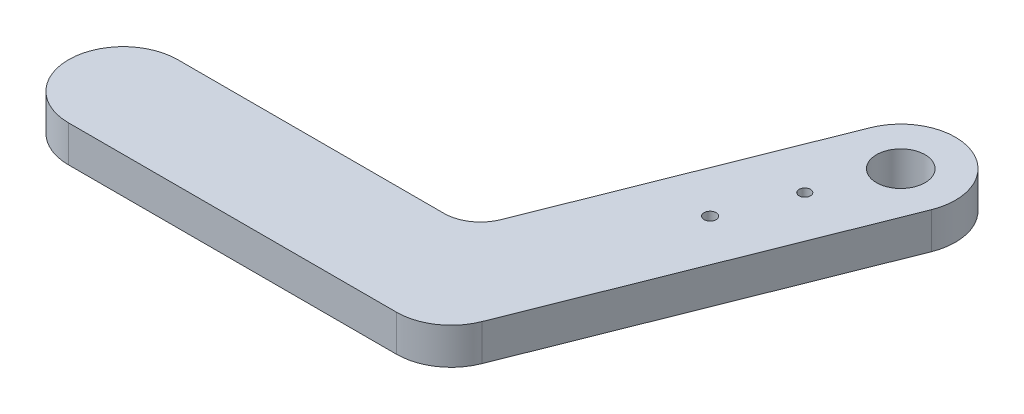
ISO-10303-21;
HEADER;
FILE_DESCRIPTION(('STEP AP214'),'2;1');
FILE_NAME('part.step','',(''),(''),'','','');
FILE_SCHEMA(('AUTOMOTIVE_DESIGN { 1 0 10303 214 1 1 1 1 }'));
ENDSEC;
DATA;
#1=APPLICATION_CONTEXT('core data for automotive mechanical design processes');
#2=APPLICATION_PROTOCOL_DEFINITION('international standard','automotive_design',2000,#1);
#3=PRODUCT_CONTEXT('',#1,'mechanical');
#4=PRODUCT('Part','Part','',(#3));
#5=PRODUCT_RELATED_PRODUCT_CATEGORY('part','',(#4));
#6=PRODUCT_DEFINITION_FORMATION('','',#4);
#7=PRODUCT_DEFINITION_CONTEXT('part definition',#1,'design');
#8=PRODUCT_DEFINITION('design','',#6,#7);
#9=PRODUCT_DEFINITION_SHAPE('','',#8);
#10=(LENGTH_UNIT() NAMED_UNIT(*) SI_UNIT(.MILLI.,.METRE.));
#11=(NAMED_UNIT(*) PLANE_ANGLE_UNIT() SI_UNIT($,.RADIAN.));
#12=(NAMED_UNIT(*) SI_UNIT($,.STERADIAN.) SOLID_ANGLE_UNIT());
#13=UNCERTAINTY_MEASURE_WITH_UNIT(LENGTH_MEASURE(1.E-05),#10,'distance_accuracy_value','');
#14=(GEOMETRIC_REPRESENTATION_CONTEXT(3) GLOBAL_UNCERTAINTY_ASSIGNED_CONTEXT((#13)) GLOBAL_UNIT_ASSIGNED_CONTEXT((#10,
#11,#12)) REPRESENTATION_CONTEXT('',''));
#15=CARTESIAN_POINT('',(0.,0.,0.));
#16=DIRECTION('',(0.,0.,1.));
#17=DIRECTION('',(1.,0.,0.));
#18=AXIS2_PLACEMENT_3D('',#15,#16,#17);
#19=CARTESIAN_POINT('',(16.6070872477086,3.,-21.11705231599));
#20=DIRECTION('',(0.,-1.,0.));
#21=DIRECTION('',(0.,0.,-1.));
#22=AXIS2_PLACEMENT_3D('',#19,#20,#21);
#23=PLANE('',#22);
#24=CARTESIAN_POINT('',(16.6070872477086,3.,-21.11705231599));
#25=DIRECTION('',(0.,1.,0.));
#26=DIRECTION('',(0.,0.,-1.));
#27=AXIS2_PLACEMENT_3D('',#24,#25,#26);
#28=CIRCLE('',#27,4.5);
#29=CARTESIAN_POINT('',(20.7889791559015,3.,-19.4551918921904));
#30=VERTEX_POINT('',#29);
#31=CARTESIAN_POINT('',(12.4251953395158,3.,-22.7789127397895));
#32=VERTEX_POINT('',#31);
#33=EDGE_CURVE('E145',#30,#32,#28,.T.);
#34=ORIENTED_EDGE('',*,*,#33,.T.);
#35=DIRECTION('',(-0.369302316399907,0.,0.92930931293174));
#36=VECTOR('',#35,1.);
#37=CARTESIAN_POINT('',(12.4251953395158,3.,-22.7789127397895));
#38=LINE('',#37,#36);
#39=CARTESIAN_POINT('',(3.7798472766123,3.,-1.02382994823567));
#40=VERTEX_POINT('',#39);
#41=EDGE_CURVE('E93',#32,#40,#38,.T.);
#42=ORIENTED_EDGE('',*,*,#41,.T.);
#43=CARTESIAN_POINT('',(0.991919337817082,3.,-2.13173689743539));
#44=DIRECTION('',(0.,-1.,0.));
#45=DIRECTION('',(0.,0.,-1.));
#46=AXIS2_PLACEMENT_3D('',#43,#44,#45);
#47=CIRCLE('',#46,3.);
#48=CARTESIAN_POINT('',(0.991919337817078,3.,0.868263102564605));
#49=VERTEX_POINT('',#48);
#50=EDGE_CURVE('E160',#40,#49,#47,.T.);
#51=ORIENTED_EDGE('',*,*,#50,.T.);
#52=DIRECTION('',(-1.,0.,0.));
#53=VECTOR('',#52,1.);
#54=CARTESIAN_POINT('',(0.991919337817078,3.,0.868263102564605));
#55=LINE('',#54,#53);
#56=CARTESIAN_POINT('',(-20.9180287696887,3.,0.868263102564611));
#57=VERTEX_POINT('',#56);
#58=EDGE_CURVE('E173',#49,#57,#55,.T.);
#59=ORIENTED_EDGE('',*,*,#58,.T.);
#60=CARTESIAN_POINT('',(-20.9180287696887,3.,5.36826310256461));
#61=DIRECTION('',(0.,1.,0.));
#62=DIRECTION('',(0.,0.,1.));
#63=AXIS2_PLACEMENT_3D('',#60,#61,#62);
#64=CIRCLE('',#63,4.5);
#65=CARTESIAN_POINT('',(-20.9180287696887,3.,9.86826310256457));
#66=VERTEX_POINT('',#65);
#67=EDGE_CURVE('E112',#57,#66,#64,.T.);
#68=ORIENTED_EDGE('',*,*,#67,.T.);
#69=DIRECTION('',(1.,0.,0.));
#70=VECTOR('',#69,1.);
#71=CARTESIAN_POINT('',(-20.9180287696887,3.,9.86826310256457));
#72=LINE('',#71,#70);
#73=CARTESIAN_POINT('',(6.08197123031129,3.,9.86826310256461));
#74=VERTEX_POINT('',#73);
#75=EDGE_CURVE('E106',#66,#74,#72,.T.);
#76=ORIENTED_EDGE('',*,*,#75,.T.);
#77=CARTESIAN_POINT('',(6.08197123031129,3.,5.36826310256461));
#78=DIRECTION('',(0.,1.,0.));
#79=DIRECTION('',(0.,0.,-1.));
#80=AXIS2_PLACEMENT_3D('',#77,#78,#79);
#81=CIRCLE('',#80,4.5);
#82=CARTESIAN_POINT('',(10.2638631385041,3.,7.03012352636419));
#83=VERTEX_POINT('',#82);
#84=EDGE_CURVE('E110',#74,#83,#81,.T.);
#85=ORIENTED_EDGE('',*,*,#84,.T.);
#86=DIRECTION('',(0.369302316399907,0.,-0.92930931293174));
#87=VECTOR('',#86,1.);
#88=CARTESIAN_POINT('',(20.7889791559015,3.,-19.4551918921904));
#89=LINE('',#88,#87);
#90=EDGE_CURVE('E50',#83,#30,#89,.T.);
#91=ORIENTED_EDGE('',*,*,#90,.T.);
#92=EDGE_LOOP('',(#34,#42,#51,#59,#68,#76,#85,#91));
#93=FACE_BOUND('',#92,.T.);
#94=CARTESIAN_POINT('',(12.1440687540158,3.,-9.88634926920988));
#95=DIRECTION('',(0.,1.,0.));
#96=DIRECTION('',(0.,0.,1.));
#97=AXIS2_PLACEMENT_3D('',#94,#95,#96);
#98=CIRCLE('',#97,0.500000000000001);
#99=CARTESIAN_POINT('',(12.1440687540158,3.,-9.38634926920988));
#100=VERTEX_POINT('',#99);
#101=EDGE_CURVE('E134',#100,#100,#98,.T.);
#102=ORIENTED_EDGE('',*,*,#101,.F.);
#103=EDGE_LOOP('',(#102));
#104=FACE_BOUND('',#103,.T.);
#105=CARTESIAN_POINT('',(16.6070872477086,3.,-21.11705231599));
#106=DIRECTION('',(0.,1.,0.));
#107=DIRECTION('',(0.,0.,1.));
#108=AXIS2_PLACEMENT_3D('',#105,#106,#107);
#109=CIRCLE('',#108,2.00000000000001);
#110=CARTESIAN_POINT('',(16.6070872477086,3.,-19.11705231599));
#111=VERTEX_POINT('',#110);
#112=EDGE_CURVE('E182',#111,#111,#109,.T.);
#113=ORIENTED_EDGE('',*,*,#112,.F.);
#114=EDGE_LOOP('',(#113));
#115=FACE_BOUND('',#114,.T.);
#116=CARTESIAN_POINT('',(14.3598826524152,3.,-15.4622051468003));
#117=DIRECTION('',(0.,1.,0.));
#118=DIRECTION('',(0.,0.,1.));
#119=AXIS2_PLACEMENT_3D('',#116,#117,#118);
#120=CIRCLE('',#119,0.467640606648929);
#121=CARTESIAN_POINT('',(14.3598826524152,3.,-14.9945645401514));
#122=VERTEX_POINT('',#121);
#123=EDGE_CURVE('E188',#122,#122,#120,.T.);
#124=ORIENTED_EDGE('',*,*,#123,.F.);
#125=EDGE_LOOP('',(#124));
#126=FACE_BOUND('',#125,.T.);
#127=ADVANCED_FACE('F33',(#93,#104,#115,#126),#23,.F.);
#128=CARTESIAN_POINT('',(16.6070872477086,0.,-21.11705231599));
#129=DIRECTION('',(0.,-1.,0.));
#130=DIRECTION('',(0.,0.,-1.));
#131=AXIS2_PLACEMENT_3D('',#128,#129,#130);
#132=PLANE('',#131);
#133=CARTESIAN_POINT('',(16.6070872477086,0.,-21.11705231599));
#134=DIRECTION('',(0.,1.,0.));
#135=DIRECTION('',(0.,0.,1.));
#136=AXIS2_PLACEMENT_3D('',#133,#134,#135);
#137=CIRCLE('',#136,2.00000000000001);
#138=CARTESIAN_POINT('',(16.6070872477086,0.,-19.11705231599));
#139=VERTEX_POINT('',#138);
#140=EDGE_CURVE('E185',#139,#139,#137,.T.);
#141=ORIENTED_EDGE('',*,*,#140,.T.);
#142=EDGE_LOOP('',(#141));
#143=FACE_BOUND('',#142,.T.);
#144=CARTESIAN_POINT('',(16.6070872477086,0.,-21.11705231599));
#145=DIRECTION('',(0.,1.,0.));
#146=DIRECTION('',(0.,0.,-1.));
#147=AXIS2_PLACEMENT_3D('',#144,#145,#146);
#148=CIRCLE('',#147,4.5);
#149=CARTESIAN_POINT('',(20.7889791559015,0.,-19.4551918921904));
#150=VERTEX_POINT('',#149);
#151=CARTESIAN_POINT('',(12.4251953395158,0.,-22.7789127397895));
#152=VERTEX_POINT('',#151);
#153=EDGE_CURVE('E130',#150,#152,#148,.T.);
#154=ORIENTED_EDGE('',*,*,#153,.F.);
#155=DIRECTION('',(0.369302316399907,0.,-0.92930931293174));
#156=VECTOR('',#155,1.);
#157=CARTESIAN_POINT('',(20.7889791559015,0.,-19.4551918921904));
#158=LINE('',#157,#156);
#159=CARTESIAN_POINT('',(10.2638631385041,0.,7.03012352636419));
#160=VERTEX_POINT('',#159);
#161=EDGE_CURVE('E85',#160,#150,#158,.T.);
#162=ORIENTED_EDGE('',*,*,#161,.F.);
#163=CARTESIAN_POINT('',(6.08197123031129,0.,5.36826310256461));
#164=DIRECTION('',(0.,1.,0.));
#165=DIRECTION('',(0.,0.,-1.));
#166=AXIS2_PLACEMENT_3D('',#163,#164,#165);
#167=CIRCLE('',#166,4.5);
#168=CARTESIAN_POINT('',(6.08197123031129,0.,9.86826310256461));
#169=VERTEX_POINT('',#168);
#170=EDGE_CURVE('E79',#169,#160,#167,.T.);
#171=ORIENTED_EDGE('',*,*,#170,.F.);
#172=DIRECTION('',(1.,0.,0.));
#173=VECTOR('',#172,1.);
#174=CARTESIAN_POINT('',(-20.9180287696887,0.,9.86826310256457));
#175=LINE('',#174,#173);
#176=CARTESIAN_POINT('',(-20.9180287696887,0.,9.86826310256457));
#177=VERTEX_POINT('',#176);
#178=EDGE_CURVE('E120',#177,#169,#175,.T.);
#179=ORIENTED_EDGE('',*,*,#178,.F.);
#180=CARTESIAN_POINT('',(-20.9180287696887,0.,5.36826310256461));
#181=DIRECTION('',(0.,1.,0.));
#182=DIRECTION('',(0.,0.,1.));
#183=AXIS2_PLACEMENT_3D('',#180,#181,#182);
#184=CIRCLE('',#183,4.5);
#185=CARTESIAN_POINT('',(-20.9180287696887,0.,0.868263102564611));
#186=VERTEX_POINT('',#185);
#187=EDGE_CURVE('E140',#186,#177,#184,.T.);
#188=ORIENTED_EDGE('',*,*,#187,.F.);
#189=DIRECTION('',(-1.,0.,0.));
#190=VECTOR('',#189,1.);
#191=CARTESIAN_POINT('',(0.991919337817078,0.,0.868263102564605));
#192=LINE('',#191,#190);
#193=CARTESIAN_POINT('',(0.991919337817078,0.,0.868263102564605));
#194=VERTEX_POINT('',#193);
#195=EDGE_CURVE('E138',#194,#186,#192,.T.);
#196=ORIENTED_EDGE('',*,*,#195,.F.);
#197=CARTESIAN_POINT('',(0.991919337817082,0.,-2.13173689743539));
#198=DIRECTION('',(0.,-1.,0.));
#199=DIRECTION('',(0.,0.,-1.));
#200=AXIS2_PLACEMENT_3D('',#197,#198,#199);
#201=CIRCLE('',#200,3.);
#202=CARTESIAN_POINT('',(3.7798472766123,0.,-1.02382994823567));
#203=VERTEX_POINT('',#202);
#204=EDGE_CURVE('E136',#203,#194,#201,.T.);
#205=ORIENTED_EDGE('',*,*,#204,.F.);
#206=DIRECTION('',(-0.369302316399907,0.,0.92930931293174));
#207=VECTOR('',#206,1.);
#208=CARTESIAN_POINT('',(12.4251953395158,0.,-22.7789127397895));
#209=LINE('',#208,#207);
#210=EDGE_CURVE('E133',#152,#203,#209,.T.);
#211=ORIENTED_EDGE('',*,*,#210,.F.);
#212=EDGE_LOOP('',(#154,#162,#171,#179,#188,#196,#205,#211));
#213=FACE_BOUND('',#212,.T.);
#214=CARTESIAN_POINT('',(12.1440687540158,0.,-9.88634926920988));
#215=DIRECTION('',(0.,1.,0.));
#216=DIRECTION('',(0.,0.,1.));
#217=AXIS2_PLACEMENT_3D('',#214,#215,#216);
#218=CIRCLE('',#217,0.500000000000001);
#219=CARTESIAN_POINT('',(12.1440687540158,0.,-9.38634926920988));
#220=VERTEX_POINT('',#219);
#221=EDGE_CURVE('E179',#220,#220,#218,.T.);
#222=ORIENTED_EDGE('',*,*,#221,.T.);
#223=EDGE_LOOP('',(#222));
#224=FACE_BOUND('',#223,.T.);
#225=CARTESIAN_POINT('',(14.3598826524152,0.,-15.4622051468003));
#226=DIRECTION('',(0.,1.,0.));
#227=DIRECTION('',(0.,0.,1.));
#228=AXIS2_PLACEMENT_3D('',#225,#226,#227);
#229=CIRCLE('',#228,0.467640606648929);
#230=CARTESIAN_POINT('',(14.3598826524152,0.,-14.9945645401514));
#231=VERTEX_POINT('',#230);
#232=EDGE_CURVE('E191',#231,#231,#229,.T.);
#233=ORIENTED_EDGE('',*,*,#232,.T.);
#234=EDGE_LOOP('',(#233));
#235=FACE_BOUND('',#234,.T.);
#236=ADVANCED_FACE('F164',(#143,#213,#224,#235),#132,.T.);
#237=CARTESIAN_POINT('',(16.6070872477086,3.,-21.11705231599));
#238=DIRECTION('',(0.,-1.,0.));
#239=DIRECTION('',(0.,0.,-1.));
#240=AXIS2_PLACEMENT_3D('',#237,#238,#239);
#241=CYLINDRICAL_SURFACE('',#240,4.5);
#242=ORIENTED_EDGE('',*,*,#153,.T.);
#243=DIRECTION('',(0.,-1.,0.));
#244=VECTOR('',#243,1.);
#245=CARTESIAN_POINT('',(12.4251953395158,3.,-22.7789127397895));
#246=LINE('',#245,#244);
#247=EDGE_CURVE('E11',#32,#152,#246,.T.);
#248=ORIENTED_EDGE('',*,*,#247,.F.);
#249=ORIENTED_EDGE('',*,*,#33,.F.);
#250=DIRECTION('',(0.,-1.,0.));
#251=VECTOR('',#250,1.);
#252=CARTESIAN_POINT('',(20.7889791559015,3.,-19.4551918921904));
#253=LINE('',#252,#251);
#254=EDGE_CURVE('E126',#30,#150,#253,.T.);
#255=ORIENTED_EDGE('',*,*,#254,.T.);
#256=EDGE_LOOP('',(#242,#248,#249,#255));
#257=FACE_BOUND('',#256,.T.);
#258=ADVANCED_FACE('F35',(#257),#241,.T.);
#259=CARTESIAN_POINT('',(12.4251953395158,3.,-22.7789127397895));
#260=DIRECTION('',(0.92930931293174,0.,0.369302316399907));
#261=DIRECTION('',(0.369302316399907,0.,-0.92930931293174));
#262=AXIS2_PLACEMENT_3D('',#259,#260,#261);
#263=PLANE('',#262);
#264=ORIENTED_EDGE('',*,*,#210,.T.);
#265=DIRECTION('',(0.,-1.,0.));
#266=VECTOR('',#265,1.);
#267=CARTESIAN_POINT('',(3.7798472766123,3.,-1.02382994823567));
#268=LINE('',#267,#266);
#269=EDGE_CURVE('E42',#40,#203,#268,.T.);
#270=ORIENTED_EDGE('',*,*,#269,.F.);
#271=ORIENTED_EDGE('',*,*,#41,.F.);
#272=ORIENTED_EDGE('',*,*,#247,.T.);
#273=EDGE_LOOP('',(#264,#270,#271,#272));
#274=FACE_BOUND('',#273,.T.);
#275=ADVANCED_FACE('F223',(#274),#263,.F.);
#276=CARTESIAN_POINT('',(0.991919337817082,3.,-2.13173689743539));
#277=DIRECTION('',(0.,-1.,0.));
#278=DIRECTION('',(0.,0.,-1.));
#279=AXIS2_PLACEMENT_3D('',#276,#277,#278);
#280=CYLINDRICAL_SURFACE('',#279,3.);
#281=ORIENTED_EDGE('',*,*,#204,.T.);
#282=DIRECTION('',(0.,-1.,0.));
#283=VECTOR('',#282,1.);
#284=CARTESIAN_POINT('',(0.991919337817078,3.,0.868263102564605));
#285=LINE('',#284,#283);
#286=EDGE_CURVE('E152',#49,#194,#285,.T.);
#287=ORIENTED_EDGE('',*,*,#286,.F.);
#288=ORIENTED_EDGE('',*,*,#50,.F.);
#289=ORIENTED_EDGE('',*,*,#269,.T.);
#290=EDGE_LOOP('',(#281,#287,#288,#289));
#291=FACE_BOUND('',#290,.T.);
#292=ADVANCED_FACE('F158',(#291),#280,.F.);
#293=CARTESIAN_POINT('',(0.991919337817078,3.,0.868263102564605));
#294=DIRECTION('',(0.,0.,1.));
#295=DIRECTION('',(1.,0.,0.));
#296=AXIS2_PLACEMENT_3D('',#293,#294,#295);
#297=PLANE('',#296);
#298=ORIENTED_EDGE('',*,*,#195,.T.);
#299=DIRECTION('',(0.,-1.,0.));
#300=VECTOR('',#299,1.);
#301=CARTESIAN_POINT('',(-20.9180287696887,3.,0.868263102564611));
#302=LINE('',#301,#300);
#303=EDGE_CURVE('E149',#57,#186,#302,.T.);
#304=ORIENTED_EDGE('',*,*,#303,.F.);
#305=ORIENTED_EDGE('',*,*,#58,.F.);
#306=ORIENTED_EDGE('',*,*,#286,.T.);
#307=EDGE_LOOP('',(#298,#304,#305,#306));
#308=FACE_BOUND('',#307,.T.);
#309=ADVANCED_FACE('F169',(#308),#297,.F.);
#310=CARTESIAN_POINT('',(-20.9180287696887,3.,5.36826310256461));
#311=DIRECTION('',(0.,-1.,0.));
#312=DIRECTION('',(0.,0.,-1.));
#313=AXIS2_PLACEMENT_3D('',#310,#311,#312);
#314=CYLINDRICAL_SURFACE('',#313,4.5);
#315=ORIENTED_EDGE('',*,*,#187,.T.);
#316=DIRECTION('',(0.,-1.,0.));
#317=VECTOR('',#316,1.);
#318=CARTESIAN_POINT('',(-20.9180287696887,3.,9.86826310256457));
#319=LINE('',#318,#317);
#320=EDGE_CURVE('E121',#66,#177,#319,.T.);
#321=ORIENTED_EDGE('',*,*,#320,.F.);
#322=ORIENTED_EDGE('',*,*,#67,.F.);
#323=ORIENTED_EDGE('',*,*,#303,.T.);
#324=EDGE_LOOP('',(#315,#321,#322,#323));
#325=FACE_BOUND('',#324,.T.);
#326=ADVANCED_FACE('F172',(#325),#314,.T.);
#327=CARTESIAN_POINT('',(-20.9180287696887,3.,9.86826310256457));
#328=DIRECTION('',(0.,0.,-1.));
#329=DIRECTION('',(-1.,0.,0.));
#330=AXIS2_PLACEMENT_3D('',#327,#328,#329);
#331=PLANE('',#330);
#332=ORIENTED_EDGE('',*,*,#178,.T.);
#333=DIRECTION('',(0.,-1.,0.));
#334=VECTOR('',#333,1.);
#335=CARTESIAN_POINT('',(6.08197123031129,3.,9.86826310256461));
#336=LINE('',#335,#334);
#337=EDGE_CURVE('E117',#74,#169,#336,.T.);
#338=ORIENTED_EDGE('',*,*,#337,.F.);
#339=ORIENTED_EDGE('',*,*,#75,.F.);
#340=ORIENTED_EDGE('',*,*,#320,.T.);
#341=EDGE_LOOP('',(#332,#338,#339,#340));
#342=FACE_BOUND('',#341,.T.);
#343=ADVANCED_FACE('F118',(#342),#331,.F.);
#344=CARTESIAN_POINT('',(6.08197123031129,3.,5.36826310256461));
#345=DIRECTION('',(0.,-1.,0.));
#346=DIRECTION('',(0.,0.,-1.));
#347=AXIS2_PLACEMENT_3D('',#344,#345,#346);
#348=CYLINDRICAL_SURFACE('',#347,4.5);
#349=ORIENTED_EDGE('',*,*,#170,.T.);
#350=DIRECTION('',(0.,-1.,0.));
#351=VECTOR('',#350,1.);
#352=CARTESIAN_POINT('',(10.2638631385041,3.,7.03012352636419));
#353=LINE('',#352,#351);
#354=EDGE_CURVE('E122',#83,#160,#353,.T.);
#355=ORIENTED_EDGE('',*,*,#354,.F.);
#356=ORIENTED_EDGE('',*,*,#84,.F.);
#357=ORIENTED_EDGE('',*,*,#337,.T.);
#358=EDGE_LOOP('',(#349,#355,#356,#357));
#359=FACE_BOUND('',#358,.T.);
#360=ADVANCED_FACE('F124',(#359),#348,.T.);
#361=CARTESIAN_POINT('',(20.7889791559015,3.,-19.4551918921904));
#362=DIRECTION('',(-0.92930931293174,0.,-0.369302316399907));
#363=DIRECTION('',(-0.369302316399907,0.,0.92930931293174));
#364=AXIS2_PLACEMENT_3D('',#361,#362,#363);
#365=PLANE('',#364);
#366=ORIENTED_EDGE('',*,*,#161,.T.);
#367=ORIENTED_EDGE('',*,*,#254,.F.);
#368=ORIENTED_EDGE('',*,*,#90,.F.);
#369=ORIENTED_EDGE('',*,*,#354,.T.);
#370=EDGE_LOOP('',(#366,#367,#368,#369));
#371=FACE_BOUND('',#370,.T.);
#372=ADVANCED_FACE('F211',(#371),#365,.F.);
#373=CARTESIAN_POINT('',(12.1440687540158,3.,-9.88634926920988));
#374=DIRECTION('',(0.,-1.,0.));
#375=DIRECTION('',(0.,0.,-1.));
#376=AXIS2_PLACEMENT_3D('',#373,#374,#375);
#377=CYLINDRICAL_SURFACE('',#376,0.500000000000001);
#378=ORIENTED_EDGE('',*,*,#101,.T.);
#379=EDGE_LOOP('',(#378));
#380=FACE_BOUND('',#379,.T.);
#381=ORIENTED_EDGE('',*,*,#221,.F.);
#382=EDGE_LOOP('',(#381));
#383=FACE_BOUND('',#382,.T.);
#384=ADVANCED_FACE('F208',(#380,#383),#377,.F.);
#385=CARTESIAN_POINT('',(16.6070872477086,3.,-21.11705231599));
#386=DIRECTION('',(0.,-1.,0.));
#387=DIRECTION('',(0.,0.,-1.));
#388=AXIS2_PLACEMENT_3D('',#385,#386,#387);
#389=CYLINDRICAL_SURFACE('',#388,2.00000000000001);
#390=ORIENTED_EDGE('',*,*,#112,.T.);
#391=EDGE_LOOP('',(#390));
#392=FACE_BOUND('',#391,.T.);
#393=ORIENTED_EDGE('',*,*,#140,.F.);
#394=EDGE_LOOP('',(#393));
#395=FACE_BOUND('',#394,.T.);
#396=ADVANCED_FACE('F287',(#392,#395),#389,.F.);
#397=CARTESIAN_POINT('',(14.3598826524152,3.,-15.4622051468003));
#398=DIRECTION('',(0.,-1.,0.));
#399=DIRECTION('',(0.,0.,-1.));
#400=AXIS2_PLACEMENT_3D('',#397,#398,#399);
#401=CYLINDRICAL_SURFACE('',#400,0.467640606648929);
#402=ORIENTED_EDGE('',*,*,#123,.T.);
#403=EDGE_LOOP('',(#402));
#404=FACE_BOUND('',#403,.T.);
#405=ORIENTED_EDGE('',*,*,#232,.F.);
#406=EDGE_LOOP('',(#405));
#407=FACE_BOUND('',#406,.T.);
#408=ADVANCED_FACE('F197',(#404,#407),#401,.F.);
#409=CLOSED_SHELL('',(#127,#236,#258,#275,#292,#309,#326,#343,#360,#372,#384,#396,#408));
#410=MANIFOLD_SOLID_BREP('B2',#409);
#411=ADVANCED_BREP_SHAPE_REPRESENTATION('',(#18,#410),#14);
#412=SHAPE_DEFINITION_REPRESENTATION(#9,#411);
ENDSEC;
END-ISO-10303-21;
